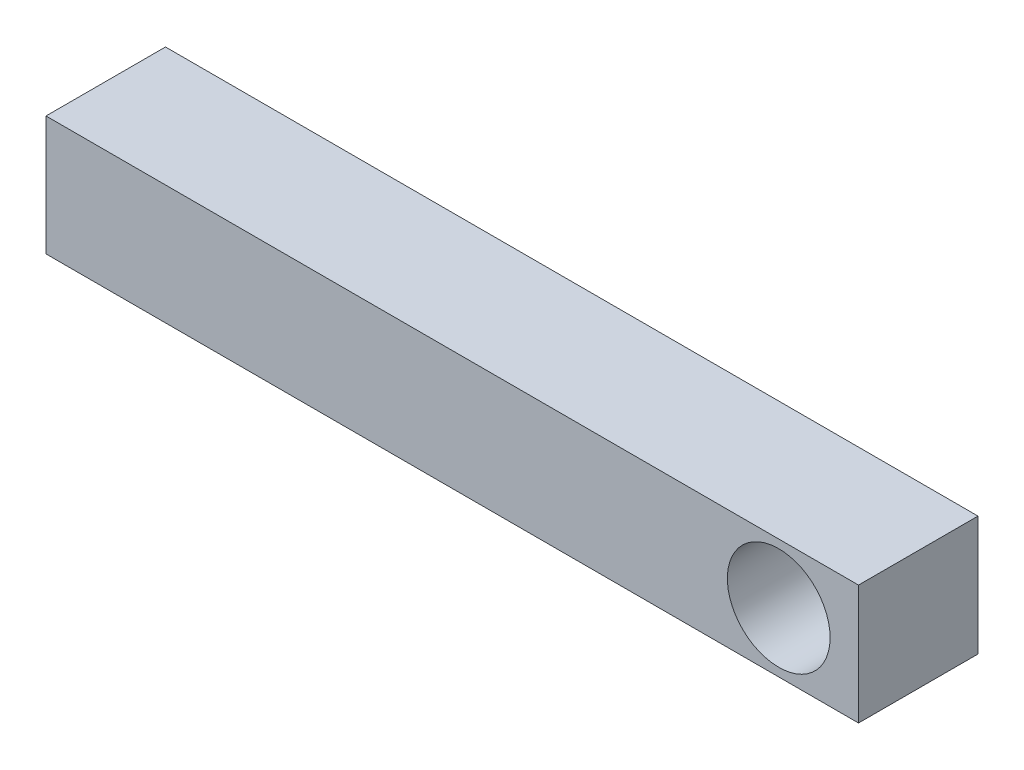
ISO-10303-21;
HEADER;
FILE_DESCRIPTION(('STEP AP214'),'2;1');
FILE_NAME('part.step','',(''),(''),'','','');
FILE_SCHEMA(('AUTOMOTIVE_DESIGN { 1 0 10303 214 1 1 1 1 }'));
ENDSEC;
DATA;
#1=APPLICATION_CONTEXT('core data for automotive mechanical design processes');
#2=APPLICATION_PROTOCOL_DEFINITION('international standard','automotive_design',2000,#1);
#3=PRODUCT_CONTEXT('',#1,'mechanical');
#4=PRODUCT('Part','Part','',(#3));
#5=PRODUCT_RELATED_PRODUCT_CATEGORY('part','',(#4));
#6=PRODUCT_DEFINITION_FORMATION('','',#4);
#7=PRODUCT_DEFINITION_CONTEXT('part definition',#1,'design');
#8=PRODUCT_DEFINITION('design','',#6,#7);
#9=PRODUCT_DEFINITION_SHAPE('','',#8);
#10=(LENGTH_UNIT() NAMED_UNIT(*) SI_UNIT(.MILLI.,.METRE.));
#11=(NAMED_UNIT(*) PLANE_ANGLE_UNIT() SI_UNIT($,.RADIAN.));
#12=(NAMED_UNIT(*) SI_UNIT($,.STERADIAN.) SOLID_ANGLE_UNIT());
#13=UNCERTAINTY_MEASURE_WITH_UNIT(LENGTH_MEASURE(1.E-05),#10,'distance_accuracy_value','');
#14=(GEOMETRIC_REPRESENTATION_CONTEXT(3) GLOBAL_UNCERTAINTY_ASSIGNED_CONTEXT((#13)) GLOBAL_UNIT_ASSIGNED_CONTEXT((#10,
#11,#12)) REPRESENTATION_CONTEXT('',''));
#15=CARTESIAN_POINT('',(0.,0.,0.));
#16=DIRECTION('',(0.,0.,1.));
#17=DIRECTION('',(1.,0.,0.));
#18=AXIS2_PLACEMENT_3D('',#15,#16,#17);
#19=CARTESIAN_POINT('',(-17.,2.5,5.));
#20=DIRECTION('',(1.,0.,0.));
#21=DIRECTION('',(0.,0.,-1.));
#22=AXIS2_PLACEMENT_3D('',#19,#20,#21);
#23=PLANE('',#22);
#24=DIRECTION('',(0.,-1.,0.));
#25=VECTOR('',#24,1.);
#26=CARTESIAN_POINT('',(-17.,2.5,0.));
#27=LINE('',#26,#25);
#28=CARTESIAN_POINT('',(-17.,2.5,0.));
#29=VERTEX_POINT('',#28);
#30=CARTESIAN_POINT('',(-17.,-2.5,0.));
#31=VERTEX_POINT('',#30);
#32=EDGE_CURVE('E107',#29,#31,#27,.T.);
#33=ORIENTED_EDGE('',*,*,#32,.T.);
#34=DIRECTION('',(0.,0.,-1.));
#35=VECTOR('',#34,1.);
#36=CARTESIAN_POINT('',(-17.,-2.5,5.));
#37=LINE('',#36,#35);
#38=CARTESIAN_POINT('',(-17.,-2.5,5.));
#39=VERTEX_POINT('',#38);
#40=EDGE_CURVE('E11',#39,#31,#37,.T.);
#41=ORIENTED_EDGE('',*,*,#40,.F.);
#42=DIRECTION('',(0.,-1.,0.));
#43=VECTOR('',#42,1.);
#44=CARTESIAN_POINT('',(-17.,2.5,5.));
#45=LINE('',#44,#43);
#46=CARTESIAN_POINT('',(-17.,2.5,5.));
#47=VERTEX_POINT('',#46);
#48=EDGE_CURVE('E91',#47,#39,#45,.T.);
#49=ORIENTED_EDGE('',*,*,#48,.F.);
#50=DIRECTION('',(0.,0.,-1.));
#51=VECTOR('',#50,1.);
#52=CARTESIAN_POINT('',(-17.,2.5,5.));
#53=LINE('',#52,#51);
#54=EDGE_CURVE('E103',#47,#29,#53,.T.);
#55=ORIENTED_EDGE('',*,*,#54,.T.);
#56=EDGE_LOOP('',(#33,#41,#49,#55));
#57=FACE_BOUND('',#56,.T.);
#58=ADVANCED_FACE('F39',(#57),#23,.F.);
#59=CARTESIAN_POINT('',(-17.,-2.5,5.));
#60=DIRECTION('',(0.,1.,0.));
#61=DIRECTION('',(-1.,0.,0.));
#62=AXIS2_PLACEMENT_3D('',#59,#60,#61);
#63=PLANE('',#62);
#64=DIRECTION('',(1.,0.,0.));
#65=VECTOR('',#64,1.);
#66=CARTESIAN_POINT('',(-17.,-2.5,0.));
#67=LINE('',#66,#65);
#68=CARTESIAN_POINT('',(17.,-2.5,0.));
#69=VERTEX_POINT('',#68);
#70=EDGE_CURVE('E96',#31,#69,#67,.T.);
#71=ORIENTED_EDGE('',*,*,#70,.T.);
#72=DIRECTION('',(0.,0.,-1.));
#73=VECTOR('',#72,1.);
#74=CARTESIAN_POINT('',(17.,-2.5,5.));
#75=LINE('',#74,#73);
#76=CARTESIAN_POINT('',(17.,-2.5,5.));
#77=VERTEX_POINT('',#76);
#78=EDGE_CURVE('E48',#77,#69,#75,.T.);
#79=ORIENTED_EDGE('',*,*,#78,.F.);
#80=DIRECTION('',(1.,0.,0.));
#81=VECTOR('',#80,1.);
#82=CARTESIAN_POINT('',(-17.,-2.5,5.));
#83=LINE('',#82,#81);
#84=EDGE_CURVE('E86',#39,#77,#83,.T.);
#85=ORIENTED_EDGE('',*,*,#84,.F.);
#86=ORIENTED_EDGE('',*,*,#40,.T.);
#87=EDGE_LOOP('',(#71,#79,#85,#86));
#88=FACE_BOUND('',#87,.T.);
#89=ADVANCED_FACE('F95',(#88),#63,.F.);
#90=CARTESIAN_POINT('',(17.,2.5,5.));
#91=DIRECTION('',(-1.,0.,0.));
#92=DIRECTION('',(0.,0.,1.));
#93=AXIS2_PLACEMENT_3D('',#90,#91,#92);
#94=PLANE('',#93);
#95=DIRECTION('',(0.,1.,0.));
#96=VECTOR('',#95,1.);
#97=CARTESIAN_POINT('',(17.,2.5,0.));
#98=LINE('',#97,#96);
#99=CARTESIAN_POINT('',(17.,2.5,0.));
#100=VERTEX_POINT('',#99);
#101=EDGE_CURVE('E73',#69,#100,#98,.T.);
#102=ORIENTED_EDGE('',*,*,#101,.T.);
#103=DIRECTION('',(0.,0.,-1.));
#104=VECTOR('',#103,1.);
#105=CARTESIAN_POINT('',(17.,2.5,5.));
#106=LINE('',#105,#104);
#107=CARTESIAN_POINT('',(17.,2.5,5.));
#108=VERTEX_POINT('',#107);
#109=EDGE_CURVE('E98',#108,#100,#106,.T.);
#110=ORIENTED_EDGE('',*,*,#109,.F.);
#111=DIRECTION('',(0.,1.,0.));
#112=VECTOR('',#111,1.);
#113=CARTESIAN_POINT('',(17.,2.5,5.));
#114=LINE('',#113,#112);
#115=EDGE_CURVE('E89',#77,#108,#114,.T.);
#116=ORIENTED_EDGE('',*,*,#115,.F.);
#117=ORIENTED_EDGE('',*,*,#78,.T.);
#118=EDGE_LOOP('',(#102,#110,#116,#117));
#119=FACE_BOUND('',#118,.T.);
#120=ADVANCED_FACE('F99',(#119),#94,.F.);
#121=CARTESIAN_POINT('',(-17.,2.5,5.));
#122=DIRECTION('',(0.,-1.,0.));
#123=DIRECTION('',(0.,0.,-1.));
#124=AXIS2_PLACEMENT_3D('',#121,#122,#123);
#125=PLANE('',#124);
#126=DIRECTION('',(-1.,0.,0.));
#127=VECTOR('',#126,1.);
#128=CARTESIAN_POINT('',(-17.,2.5,0.));
#129=LINE('',#128,#127);
#130=EDGE_CURVE('E79',#100,#29,#129,.T.);
#131=ORIENTED_EDGE('',*,*,#130,.T.);
#132=ORIENTED_EDGE('',*,*,#54,.F.);
#133=DIRECTION('',(-1.,0.,0.));
#134=VECTOR('',#133,1.);
#135=CARTESIAN_POINT('',(-17.,2.5,5.));
#136=LINE('',#135,#134);
#137=EDGE_CURVE('E56',#108,#47,#136,.T.);
#138=ORIENTED_EDGE('',*,*,#137,.F.);
#139=ORIENTED_EDGE('',*,*,#109,.T.);
#140=EDGE_LOOP('',(#131,#132,#138,#139));
#141=FACE_BOUND('',#140,.T.);
#142=ADVANCED_FACE('F121',(#141),#125,.F.);
#143=CARTESIAN_POINT('',(0.,0.,5.));
#144=DIRECTION('',(0.,0.,1.));
#145=DIRECTION('',(1.,0.,0.));
#146=AXIS2_PLACEMENT_3D('',#143,#144,#145);
#147=PLANE('',#146);
#148=CARTESIAN_POINT('',(13.6616068974003,0.,5.));
#149=DIRECTION('',(0.,0.,1.));
#150=DIRECTION('',(1.,0.,0.));
#151=AXIS2_PLACEMENT_3D('',#148,#149,#150);
#152=CIRCLE('',#151,2.1497751984731);
#153=CARTESIAN_POINT('',(15.8113820958734,0.,5.));
#154=VERTEX_POINT('',#153);
#155=EDGE_CURVE('E128',#154,#154,#152,.T.);
#156=ORIENTED_EDGE('',*,*,#155,.F.);
#157=EDGE_LOOP('',(#156));
#158=FACE_BOUND('',#157,.T.);
#159=ORIENTED_EDGE('',*,*,#48,.T.);
#160=ORIENTED_EDGE('',*,*,#84,.T.);
#161=ORIENTED_EDGE('',*,*,#115,.T.);
#162=ORIENTED_EDGE('',*,*,#137,.T.);
#163=EDGE_LOOP('',(#159,#160,#161,#162));
#164=FACE_BOUND('',#163,.T.);
#165=ADVANCED_FACE('F87',(#158,#164),#147,.T.);
#166=CARTESIAN_POINT('',(0.,0.,0.));
#167=DIRECTION('',(0.,0.,1.));
#168=DIRECTION('',(1.,0.,0.));
#169=AXIS2_PLACEMENT_3D('',#166,#167,#168);
#170=PLANE('',#169);
#171=CARTESIAN_POINT('',(13.6616068974003,0.,0.));
#172=DIRECTION('',(0.,0.,1.));
#173=DIRECTION('',(1.,0.,0.));
#174=AXIS2_PLACEMENT_3D('',#171,#172,#173);
#175=CIRCLE('',#174,2.1497751984731);
#176=CARTESIAN_POINT('',(15.8113820958734,0.,0.));
#177=VERTEX_POINT('',#176);
#178=EDGE_CURVE('E111',#177,#177,#175,.T.);
#179=ORIENTED_EDGE('',*,*,#178,.T.);
#180=EDGE_LOOP('',(#179));
#181=FACE_BOUND('',#180,.T.);
#182=ORIENTED_EDGE('',*,*,#32,.F.);
#183=ORIENTED_EDGE('',*,*,#130,.F.);
#184=ORIENTED_EDGE('',*,*,#101,.F.);
#185=ORIENTED_EDGE('',*,*,#70,.F.);
#186=EDGE_LOOP('',(#182,#183,#184,#185));
#187=FACE_BOUND('',#186,.T.);
#188=ADVANCED_FACE('F124',(#181,#187),#170,.F.);
#189=CARTESIAN_POINT('',(13.6616068974003,0.,0.));
#190=DIRECTION('',(0.,0.,1.));
#191=DIRECTION('',(1.,0.,0.));
#192=AXIS2_PLACEMENT_3D('',#189,#190,#191);
#193=CYLINDRICAL_SURFACE('',#192,2.1497751984731);
#194=ORIENTED_EDGE('',*,*,#178,.F.);
#195=EDGE_LOOP('',(#194));
#196=FACE_BOUND('',#195,.T.);
#197=ORIENTED_EDGE('',*,*,#155,.T.);
#198=EDGE_LOOP('',(#197));
#199=FACE_BOUND('',#198,.T.);
#200=ADVANCED_FACE('F137',(#196,#199),#193,.F.);
#201=CLOSED_SHELL('',(#58,#89,#120,#142,#165,#188,#200));
#202=MANIFOLD_SOLID_BREP('B2',#201);
#203=ADVANCED_BREP_SHAPE_REPRESENTATION('',(#18,#202),#14);
#204=SHAPE_DEFINITION_REPRESENTATION(#9,#203);
ENDSEC;
END-ISO-10303-21;
